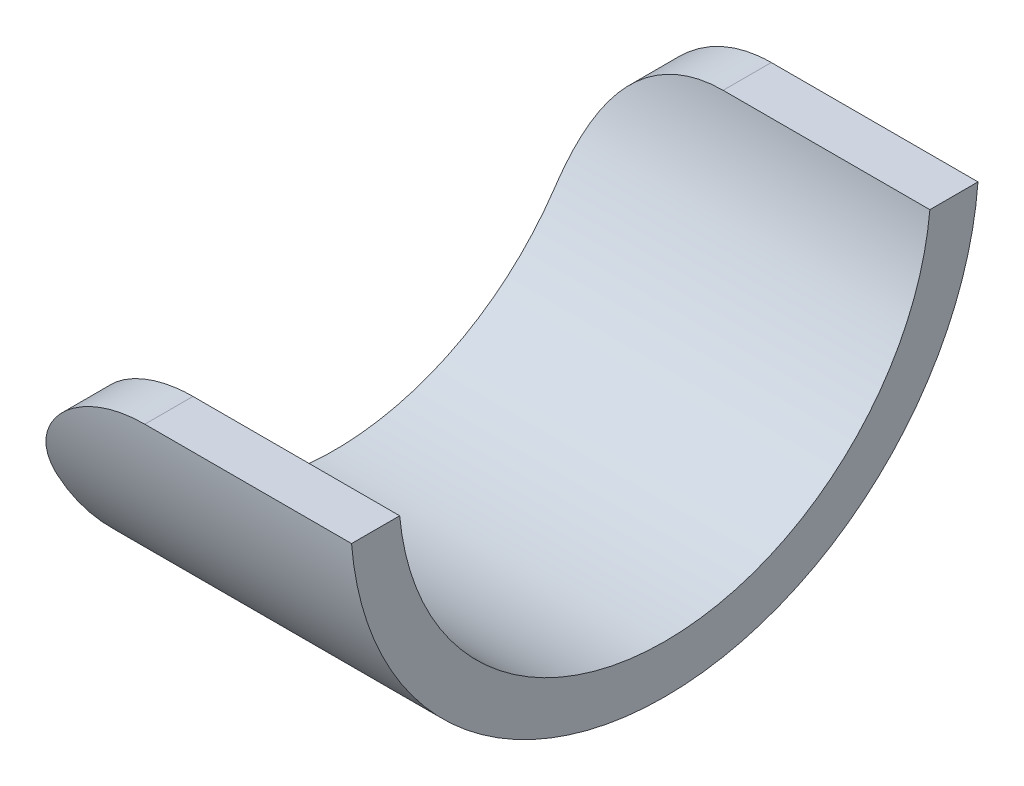
ISO-10303-21;
HEADER;
FILE_DESCRIPTION(('STEP AP214'),'2;1');
FILE_NAME('part.step','',(''),(''),'','','');
FILE_SCHEMA(('AUTOMOTIVE_DESIGN { 1 0 10303 214 1 1 1 1 }'));
ENDSEC;
DATA;
#1=APPLICATION_CONTEXT('core data for automotive mechanical design processes');
#2=APPLICATION_PROTOCOL_DEFINITION('international standard','automotive_design',2000,#1);
#3=PRODUCT_CONTEXT('',#1,'mechanical');
#4=PRODUCT('Part','Part','',(#3));
#5=PRODUCT_RELATED_PRODUCT_CATEGORY('part','',(#4));
#6=PRODUCT_DEFINITION_FORMATION('','',#4);
#7=PRODUCT_DEFINITION_CONTEXT('part definition',#1,'design');
#8=PRODUCT_DEFINITION('design','',#6,#7);
#9=PRODUCT_DEFINITION_SHAPE('','',#8);
#10=(LENGTH_UNIT() NAMED_UNIT(*) SI_UNIT(.MILLI.,.METRE.));
#11=(NAMED_UNIT(*) PLANE_ANGLE_UNIT() SI_UNIT($,.RADIAN.));
#12=(NAMED_UNIT(*) SI_UNIT($,.STERADIAN.) SOLID_ANGLE_UNIT());
#13=UNCERTAINTY_MEASURE_WITH_UNIT(LENGTH_MEASURE(1.E-05),#10,'distance_accuracy_value','');
#14=(GEOMETRIC_REPRESENTATION_CONTEXT(3) GLOBAL_UNCERTAINTY_ASSIGNED_CONTEXT((#13)) GLOBAL_UNIT_ASSIGNED_CONTEXT((#10,
#11,#12)) REPRESENTATION_CONTEXT('',''));
#15=CARTESIAN_POINT('',(0.,0.,0.));
#16=DIRECTION('',(0.,0.,1.));
#17=DIRECTION('',(1.,0.,0.));
#18=AXIS2_PLACEMENT_3D('',#15,#16,#17);
#19=CARTESIAN_POINT('',(25.4,0.,0.));
#20=DIRECTION('',(-1.,0.,0.));
#21=DIRECTION('',(0.,0.,1.));
#22=AXIS2_PLACEMENT_3D('',#19,#20,#21);
#23=CYLINDRICAL_SURFACE('',#22,24.13);
#24=CARTESIAN_POINT('',(0.,0.,0.));
#25=DIRECTION('',(1.,0.,0.));
#26=DIRECTION('',(0.,0.,-1.));
#27=AXIS2_PLACEMENT_3D('',#24,#25,#26);
#28=CIRCLE('',#27,24.13);
#29=CARTESIAN_POINT('',(0.,-11.43,21.2511646739655));
#30=VERTEX_POINT('',#29);
#31=CARTESIAN_POINT('',(0.,-11.43,-21.2511646739655));
#32=VERTEX_POINT('',#31);
#33=EDGE_CURVE('E159',#30,#32,#28,.T.);
#34=ORIENTED_EDGE('',*,*,#33,.T.);
#35=CARTESIAN_POINT('',(0.,-11.43,-21.2511646739655));
#36=CARTESIAN_POINT('',(-2.62243007126413E-05,-11.1860224640543,-21.3824335393108));
#37=CARTESIAN_POINT('',(0.00937477308694025,-10.9396845502003,-21.5094658719944));
#38=CARTESIAN_POINT('',(0.0479236395877504,-10.4439055163118,-21.7544876609394));
#39=CARTESIAN_POINT('',(0.0770830725086785,-10.1944626630503,-21.8724717766096));
#40=CARTESIAN_POINT('',(0.156118837118842,-9.69390311880306,-22.0988883031836));
#41=CARTESIAN_POINT('',(0.206034677985443,-9.44278413916173,-22.2073020174487));
#42=CARTESIAN_POINT('',(0.327202368802155,-8.94150477192952,-22.4138311063666));
#43=CARTESIAN_POINT('',(0.398449861662112,-8.69134419913753,-22.5119485785534));
#44=CARTESIAN_POINT('',(0.562964102877934,-8.19324315777415,-22.6979873973509));
#45=CARTESIAN_POINT('',(0.656316560719896,-7.94531533145705,-22.7858670176028));
#46=CARTESIAN_POINT('',(0.864917743170024,-7.45513554205446,-22.9509202864259));
#47=CARTESIAN_POINT('',(0.980168085088761,-7.21288399968737,-23.0280931434996));
#48=CARTESIAN_POINT('',(1.23201910546764,-6.73697795539725,-23.1717872843801));
#49=CARTESIAN_POINT('',(1.36858542185224,-6.50331035205277,-23.238325368346));
#50=CARTESIAN_POINT('',(1.66250238886438,-6.04664831564512,-23.3613112980713));
#51=CARTESIAN_POINT('',(1.81985155894157,-5.82365312382992,-23.4177598619249));
#52=CARTESIAN_POINT('',(2.14347109553134,-5.40470991060296,-23.5178520749754));
#53=CARTESIAN_POINT('',(2.3085037041298,-5.20794553211169,-23.562088255933));
#54=CARTESIAN_POINT('',(2.65479050631666,-4.82757709066209,-23.6429526368408));
#55=CARTESIAN_POINT('',(2.83604409448118,-4.64397253699317,-23.6795811205675));
#56=CARTESIAN_POINT('',(3.21363852043108,-4.29143598197451,-23.7460034791518));
#57=CARTESIAN_POINT('',(3.40998739998141,-4.12251190492314,-23.7757936768714));
#58=CARTESIAN_POINT('',(3.81630838261891,-3.80087139049984,-23.8293278664702));
#59=CARTESIAN_POINT('',(4.02628051460483,-3.64815498751076,-23.8530718455232));
#60=CARTESIAN_POINT('',(4.45704285565434,-3.36104542848596,-23.895213047223));
#61=CARTESIAN_POINT('',(4.67775947309696,-3.22654644377813,-23.9136419215247));
#62=CARTESIAN_POINT('',(5.12964311440567,-2.97581587645182,-23.9461355713094));
#63=CARTESIAN_POINT('',(5.36081023917931,-2.85958447026916,-23.960200304643));
#64=CARTESIAN_POINT('',(5.831928095831,-2.64628232956131,-23.9846954693647));
#65=CARTESIAN_POINT('',(6.07187653555342,-2.54920663658397,-23.9951268417838));
#66=CARTESIAN_POINT('',(6.55895637291033,-2.37488541721316,-24.0130070257699));
#67=CARTESIAN_POINT('',(6.80608684064031,-2.29763733623003,-24.0204562216298));
#68=CARTESIAN_POINT('',(7.25703859547032,-2.17660389124137,-24.0316919659944));
#69=CARTESIAN_POINT('',(7.45989511606065,-2.12922984902613,-24.0359096588211));
#70=CARTESIAN_POINT('',(7.86827969905803,-2.04787644322711,-24.0429774229925));
#71=CARTESIAN_POINT('',(8.07380739515986,-2.0138952626542,-24.0458276798666));
#72=CARTESIAN_POINT('',(8.48648285909893,-1.95949981658252,-24.0503232209338));
#73=CARTESIAN_POINT('',(8.69362909932989,-1.93907402968682,-24.0519695285443));
#74=CARTESIAN_POINT('',(9.10884950593469,-1.9118178800914,-24.0541447550348));
#75=CARTESIAN_POINT('',(9.31692380045259,-1.90498945704754,-24.0546735144979));
#76=CARTESIAN_POINT('',(9.525,-1.905,-24.0546850945923));
#77=B_SPLINE_CURVE_WITH_KNOTS('',3,(#35,#36,#37,#38,#39,#40,#41,#42,#43,#44,#45,#46,#47,#48,#49,
#50,#51,#52,#53,#54,#55,#56,#57,#58,#59,#60,#61,#62,#63,#64,#65,#66,#67,#68,#69,#70,#71,#72,#73,
#74,#75,#76),.UNSPECIFIED.,.F.,.F.,(4,2,2,2,2,2,2,2,2,2,2,2,2,2,2,2,2,2,2,2,4),(0.,
0.831053790770307,1.66259438406464,2.49572508742816,3.32868573588827,4.16493056434458,
5.0012371793046,5.83620930417523,6.67112197849129,7.45196225401338,8.23277339798149,
9.01400342752858,9.79523511433871,10.5717136526312,11.3481996900133,12.1244844697337,
12.9006691826562,13.5253091224103,14.1498642890198,14.7738879332271,15.3980005876607),.UNSPECIFIED.);
#78=CARTESIAN_POINT('',(9.525,-1.905,-24.0546850945923));
#79=VERTEX_POINT('',#78);
#80=EDGE_CURVE('E41',#32,#79,#77,.T.);
#81=ORIENTED_EDGE('',*,*,#80,.T.);
#82=DIRECTION('',(-1.,0.,0.));
#83=VECTOR('',#82,1.);
#84=CARTESIAN_POINT('',(25.4,-1.905,-24.0546850945923));
#85=LINE('',#84,#83);
#86=CARTESIAN_POINT('',(25.4,-1.905,-24.0546850945923));
#87=VERTEX_POINT('',#86);
#88=EDGE_CURVE('E93',#87,#79,#85,.T.);
#89=ORIENTED_EDGE('',*,*,#88,.F.);
#90=CARTESIAN_POINT('',(25.4,0.,0.));
#91=DIRECTION('',(1.,0.,0.));
#92=DIRECTION('',(0.,0.,-1.));
#93=AXIS2_PLACEMENT_3D('',#90,#91,#92);
#94=CIRCLE('',#93,24.13);
#95=CARTESIAN_POINT('',(25.4,-1.905,24.0546850945923));
#96=VERTEX_POINT('',#95);
#97=EDGE_CURVE('E100',#96,#87,#94,.T.);
#98=ORIENTED_EDGE('',*,*,#97,.F.);
#99=DIRECTION('',(-1.,0.,0.));
#100=VECTOR('',#99,1.);
#101=CARTESIAN_POINT('',(25.4,-1.905,24.0546850945923));
#102=LINE('',#101,#100);
#103=CARTESIAN_POINT('',(9.525,-1.905,24.0546850945923));
#104=VERTEX_POINT('',#103);
#105=EDGE_CURVE('E178',#96,#104,#102,.T.);
#106=ORIENTED_EDGE('',*,*,#105,.T.);
#107=CARTESIAN_POINT('',(9.525,-1.905,24.0546850945923));
#108=CARTESIAN_POINT('',(9.25902855860662,-1.90497112249098,24.0546543706783));
#109=CARTESIAN_POINT('',(8.99305996792605,-1.91613908815105,24.0538018907344));
#110=CARTESIAN_POINT('',(8.46300387273561,-1.9606612994031,24.0502314004206));
#111=CARTESIAN_POINT('',(8.1989163303127,-1.99401509654734,24.0475134277582));
#112=CARTESIAN_POINT('',(7.67456650786336,-2.08268810274374,24.0399910936523));
#113=CARTESIAN_POINT('',(7.41430308962371,-2.1380006327919,24.0351873665735));
#114=CARTESIAN_POINT('',(6.89937138401652,-2.2701777631287,24.0230644040504));
#115=CARTESIAN_POINT('',(6.6447029998715,-2.34704199031998,24.0157452121526));
#116=CARTESIAN_POINT('',(6.14260206552165,-2.52181707329971,23.9980216823762));
#117=CARTESIAN_POINT('',(5.89517469334633,-2.61974259140439,23.9876151932781));
#118=CARTESIAN_POINT('',(5.40953230749561,-2.83586324053376,23.9630257307452));
#119=CARTESIAN_POINT('',(5.17131717562001,-2.9540581113811,23.9488428057835));
#120=CARTESIAN_POINT('',(4.70588661033124,-3.20976539159897,23.9159133288637));
#121=CARTESIAN_POINT('',(4.47866874681592,-3.34727350681213,23.8971677906916));
#122=CARTESIAN_POINT('',(4.03685190596719,-3.64051036300694,23.8542560267361));
#123=CARTESIAN_POINT('',(3.82225273297257,-3.79623882135804,23.8300898850306));
#124=CARTESIAN_POINT('',(3.40913310360506,-4.12311644738061,23.7757019327644));
#125=CARTESIAN_POINT('',(3.21048485846543,-4.29411352349554,23.7455368268045));
#126=CARTESIAN_POINT('',(2.82856447170116,-4.65123007876344,23.6781748356056));
#127=CARTESIAN_POINT('',(2.64529225956836,-4.8373494885639,23.6409779826139));
#128=CARTESIAN_POINT('',(2.29548581756171,-5.22294907941939,23.5587888909164));
#129=CARTESIAN_POINT('',(2.12894399446347,-5.42242313023072,23.5138002140805));
#130=CARTESIAN_POINT('',(1.81359856584554,-5.83295582002549,23.4153383321293));
#131=CARTESIAN_POINT('',(1.6647945124326,-6.04401416629933,23.3618653413296));
#132=CARTESIAN_POINT('',(1.38874855215797,-6.47113711214399,23.2471317644862));
#133=CARTESIAN_POINT('',(1.26111596507832,-6.68700031712436,23.1860605993367));
#134=CARTESIAN_POINT('',(1.02423098390503,-7.12596104699,23.0549352631465));
#135=CARTESIAN_POINT('',(0.914978750332491,-7.34905863503499,22.9848810136632));
#136=CARTESIAN_POINT('',(0.715071957252479,-7.80069709441672,22.8355565811858));
#137=CARTESIAN_POINT('',(0.624434549431874,-8.02924277118396,22.7562780033086));
#138=CARTESIAN_POINT('',(0.461930113313286,-8.48959759740636,22.5885730040502));
#139=CARTESIAN_POINT('',(0.390061506300686,-8.72140647065202,22.5001473529379));
#140=CARTESIAN_POINT('',(0.271603413772416,-9.16141574281794,22.3243212812767));
#141=CARTESIAN_POINT('',(0.223127464472969,-9.36947657204716,22.2378315842086));
#142=CARTESIAN_POINT('',(0.140643449883782,-9.7854805725289,22.0579381550127));
#143=CARTESIAN_POINT('',(0.106635777848727,-9.99342374042991,21.9645342350342));
#144=CARTESIAN_POINT('',(0.0527401220690146,-10.4075477143405,21.771354509249));
#145=CARTESIAN_POINT('',(0.0328187663108996,-10.6137315346706,21.6715943779708));
#146=CARTESIAN_POINT('',(0.00644491721495352,-11.0238100019182,21.4659113001518));
#147=CARTESIAN_POINT('',(-1.12453408408947E-05,-11.2277052573949,21.3599900405856));
#148=CARTESIAN_POINT('',(0.,-11.43,21.2511646739655));
#149=B_SPLINE_CURVE_WITH_KNOTS('',3,(#107,#108,#109,#110,#111,#112,#113,#114,#115,#116,#117,
#118,#119,#120,#121,#122,#123,#124,#125,#126,#127,#128,#129,#130,#131,#132,#133,#134,#135,#136,
#137,#138,#139,#140,#141,#142,#143,#144,#145,#146,#147,#148),.UNSPECIFIED.,.F.,.F.,(4,2,2,2,2,2,
2,2,2,2,2,2,2,2,2,2,2,2,2,2,4),(0.,0.797674807200183,1.59533349129078,2.39274974387176,
3.19015219264293,3.98811157936095,4.78606072424157,5.58383273105668,6.38159236462163,
7.17214191497642,7.96268783999794,8.75287333268876,9.54303886831846,10.316430031771,
11.0898279491281,11.8639353089751,12.6379775347455,13.3288503903548,14.0197420230188,
14.7089913240004,15.3980527824104),.UNSPECIFIED.);
#150=EDGE_CURVE('E48',#104,#30,#149,.T.);
#151=ORIENTED_EDGE('',*,*,#150,.T.);
#152=EDGE_LOOP('',(#34,#81,#89,#98,#106,#151));
#153=FACE_BOUND('',#152,.T.);
#154=ADVANCED_FACE('F32',(#153),#23,.T.);
#155=CARTESIAN_POINT('',(25.4,-1.905,-20.3580643480661));
#156=DIRECTION('',(0.,-1.,0.));
#157=DIRECTION('',(0.,0.,-1.));
#158=AXIS2_PLACEMENT_3D('',#155,#156,#157);
#159=PLANE('',#158);
#160=ORIENTED_EDGE('',*,*,#88,.T.);
#161=DIRECTION('',(0.,0.,1.));
#162=VECTOR('',#161,1.);
#163=CARTESIAN_POINT('',(9.525,-1.905,-20.3580643480661));
#164=LINE('',#163,#162);
#165=CARTESIAN_POINT('',(9.525,-1.905,-20.3580643480661));
#166=VERTEX_POINT('',#165);
#167=EDGE_CURVE('E112',#79,#166,#164,.T.);
#168=ORIENTED_EDGE('',*,*,#167,.T.);
#169=DIRECTION('',(-1.,0.,0.));
#170=VECTOR('',#169,1.);
#171=CARTESIAN_POINT('',(25.4,-1.905,-20.3580643480661));
#172=LINE('',#171,#170);
#173=CARTESIAN_POINT('',(25.4,-1.905,-20.3580643480661));
#174=VERTEX_POINT('',#173);
#175=EDGE_CURVE('E96',#174,#166,#172,.T.);
#176=ORIENTED_EDGE('',*,*,#175,.F.);
#177=DIRECTION('',(0.,0.,1.));
#178=VECTOR('',#177,1.);
#179=CARTESIAN_POINT('',(25.4,-1.905,-20.3580643480661));
#180=LINE('',#179,#178);
#181=EDGE_CURVE('E88',#87,#174,#180,.T.);
#182=ORIENTED_EDGE('',*,*,#181,.F.);
#183=EDGE_LOOP('',(#160,#168,#176,#182));
#184=FACE_BOUND('',#183,.T.);
#185=ADVANCED_FACE('F90',(#184),#159,.F.);
#186=CARTESIAN_POINT('',(25.4,0.,0.));
#187=DIRECTION('',(-1.,0.,0.));
#188=DIRECTION('',(0.,0.,1.));
#189=AXIS2_PLACEMENT_3D('',#186,#187,#188);
#190=CYLINDRICAL_SURFACE('',#189,20.447);
#191=ORIENTED_EDGE('',*,*,#175,.T.);
#192=CARTESIAN_POINT('',(9.525,-1.905,-20.3580643480661));
#193=CARTESIAN_POINT('',(9.25978977014526,-1.90497110377044,-20.3580283743182));
#194=CARTESIAN_POINT('',(8.99458190205295,-1.91607541741178,-20.3570267347558));
#195=CARTESIAN_POINT('',(8.46603330595991,-1.96034336128463,-20.352832188804));
#196=CARTESIAN_POINT('',(8.20269256023756,-1.99350678186011,-20.3496393032408));
#197=CARTESIAN_POINT('',(7.67976710818044,-2.08168051639916,-20.3408028731761));
#198=CARTESIAN_POINT('',(7.42018195184562,-2.13668819010333,-20.3351596248361));
#199=CARTESIAN_POINT('',(6.9065823565463,-2.26813517562933,-20.3209194671558));
#200=CARTESIAN_POINT('',(6.65256781040154,-2.34457407471702,-20.312322614697));
#201=CARTESIAN_POINT('',(6.15172905872527,-2.51837915517059,-20.2915062917797));
#202=CARTESIAN_POINT('',(5.90491062304745,-2.61576163208616,-20.2792839976529));
#203=CARTESIAN_POINT('',(5.42046974204375,-2.83065885374987,-20.2504056126832));
#204=CARTESIAN_POINT('',(5.18284713201861,-2.94817323772638,-20.2337496012912));
#205=CARTESIAN_POINT('',(4.71860313323052,-3.20235227155138,-20.1950801117434));
#206=CARTESIAN_POINT('',(4.49197903223694,-3.33901216747872,-20.1730679625452));
#207=CARTESIAN_POINT('',(4.05136405145136,-3.63034088398203,-20.1226806227278));
#208=CARTESIAN_POINT('',(3.83737292244127,-3.78500934911329,-20.0943055576867));
#209=CARTESIAN_POINT('',(3.42620891630364,-4.10893379759801,-20.030560824482));
#210=CARTESIAN_POINT('',(3.22885954487623,-4.27798374878302,-19.9952828225731));
#211=CARTESIAN_POINT('',(2.84947281277147,-4.63073177356297,-19.9165452957226));
#212=CARTESIAN_POINT('',(2.66743532964771,-4.81442972999756,-19.8730858362156));
#213=CARTESIAN_POINT('',(2.32005992918782,-5.19456017598146,-19.7771267369428));
#214=CARTESIAN_POINT('',(2.15471065709082,-5.39098385541035,-19.724633310632));
#215=CARTESIAN_POINT('',(1.84162833815016,-5.79469430757571,-19.6098279166227));
#216=CARTESIAN_POINT('',(1.69389475833076,-6.00198075137795,-19.5475162461149));
#217=CARTESIAN_POINT('',(1.42089667288137,-6.41906899364777,-19.4144755131979));
#218=CARTESIAN_POINT('',(1.29510049382968,-6.62861897179975,-19.3440467118341));
#219=CARTESIAN_POINT('',(1.06130049022161,-7.05389488573657,-19.1930529525103));
#220=CARTESIAN_POINT('',(0.953296570547871,-7.26962078849771,-19.112488048742));
#221=CARTESIAN_POINT('',(0.755103699314461,-7.70549373801177,-18.9409635820805));
#222=CARTESIAN_POINT('',(0.664940401084745,-7.92564665685008,-18.8499893436497));
#223=CARTESIAN_POINT('',(0.50249570259122,-8.36804475355946,-18.6578079286869));
#224=CARTESIAN_POINT('',(0.430213517538051,-8.59028983916225,-18.5566012015262));
#225=CARTESIAN_POINT('',(0.303153739250019,-9.03487826701944,-18.3442481822495));
#226=CARTESIAN_POINT('',(0.248367946006984,-9.25722151419619,-18.23310657765));
#227=CARTESIAN_POINT('',(0.155607328845854,-9.70043791104361,-18.0012194838147));
#228=CARTESIAN_POINT('',(0.117635672778708,-9.92131077597413,-17.8804721898794));
#229=CARTESIAN_POINT('',(0.057778548534097,-10.3594428106769,-17.6302342348168));
#230=CARTESIAN_POINT('',(0.0358505781251143,-10.5767100272518,-17.5007676745597));
#231=CARTESIAN_POINT('',(0.00695864841239081,-11.0068892110165,-17.2334730625406));
#232=CARTESIAN_POINT('',(-1.40946185446643E-05,-11.2198036619075,-17.0956499678064));
#233=CARTESIAN_POINT('',(0.,-11.43,-16.9539054202859));
#234=B_SPLINE_CURVE_WITH_KNOTS('',3,(#192,#193,#194,#195,#196,#197,#198,#199,#200,#201,#202,
#203,#204,#205,#206,#207,#208,#209,#210,#211,#212,#213,#214,#215,#216,#217,#218,#219,#220,#221,
#222,#223,#224,#225,#226,#227,#228,#229,#230,#231,#232,#233),.UNSPECIFIED.,.F.,.F.,(4,2,2,2,2,2,
2,2,2,2,2,2,2,2,2,2,2,2,2,2,4),(0.,0.795393423654686,1.59077928777243,2.38606904486716,
3.18134348689319,3.97723896055609,4.77312017295292,5.5688041133931,6.3644723516572,
7.15021538340832,7.93595213111672,8.72115060258975,9.5063253112738,10.2684854549721,
11.0306415240326,11.7938856708571,12.5570963134924,13.319948736603,14.082944823085,
14.8439122217054,15.604432555074),.UNSPECIFIED.);
#235=CARTESIAN_POINT('',(0.,-11.43,-16.9539054202859));
#236=VERTEX_POINT('',#235);
#237=EDGE_CURVE('E125',#166,#236,#234,.T.);
#238=ORIENTED_EDGE('',*,*,#237,.T.);
#239=CARTESIAN_POINT('',(0.,0.,0.));
#240=DIRECTION('',(-1.,0.,0.));
#241=DIRECTION('',(0.,0.,-1.));
#242=AXIS2_PLACEMENT_3D('',#239,#240,#241);
#243=CIRCLE('',#242,20.447);
#244=CARTESIAN_POINT('',(0.,-11.43,16.9539054202859));
#245=VERTEX_POINT('',#244);
#246=EDGE_CURVE('E109',#236,#245,#243,.T.);
#247=ORIENTED_EDGE('',*,*,#246,.T.);
#248=CARTESIAN_POINT('',(0.,-11.43,16.9539054202859));
#249=CARTESIAN_POINT('',(-2.26556267190623E-05,-11.1970109347333,17.1110348965797));
#250=CARTESIAN_POINT('',(0.00854996527283876,-10.9606584924522,17.2633409521735));
#251=CARTESIAN_POINT('',(0.0441943253259937,-10.4827345096676,17.557631634213));
#252=CARTESIAN_POINT('',(0.0712805745076498,-10.241159019522,17.6996080681937));
#253=CARTESIAN_POINT('',(0.145377805371788,-9.75392492005596,17.9727321356884));
#254=CARTESIAN_POINT('',(0.192449364536353,-9.50825609668595,18.1038453856936));
#255=CARTESIAN_POINT('',(0.307566450309029,-9.01577956315671,18.3540664977231));
#256=CARTESIAN_POINT('',(0.375606449191654,-8.76897217001962,18.4731775128226));
#257=CARTESIAN_POINT('',(0.53383245903843,-8.27531248509759,18.6995490297245));
#258=CARTESIAN_POINT('',(0.624131647136172,-8.02846661678016,18.8067447749873));
#259=CARTESIAN_POINT('',(0.827078092665168,-7.53872313086899,19.0083559040058));
#260=CARTESIAN_POINT('',(0.939727382262767,-7.29582587447428,19.1027701242966));
#261=CARTESIAN_POINT('',(1.18702756275254,-6.81738744881128,19.2786895398164));
#262=CARTESIAN_POINT('',(1.32162936657595,-6.58183123312698,19.3602227547461));
#263=CARTESIAN_POINT('',(1.61248686004771,-6.12037421258529,19.5110161349573));
#264=CARTESIAN_POINT('',(1.76874040418349,-5.89447245394763,19.580277514731));
#265=CARTESIAN_POINT('',(2.08719310004087,-5.47451213954638,19.7015990829017));
#266=CARTESIAN_POINT('',(2.24764088450731,-5.27940511020473,19.7546393047696));
#267=CARTESIAN_POINT('',(2.58476100175011,-4.90138340496377,19.8518094278578));
#268=CARTESIAN_POINT('',(2.76143244282964,-4.71846805992848,19.8959398183609));
#269=CARTESIAN_POINT('',(3.12994468473486,-4.36644050139834,19.976151579886));
#270=CARTESIAN_POINT('',(3.32179551996768,-4.19733757130689,20.0122275652699));
#271=CARTESIAN_POINT('',(3.7192248194697,-3.87459604014138,20.0772114901172));
#272=CARTESIAN_POINT('',(3.92480339005321,-3.72095755885468,20.1061193740592));
#273=CARTESIAN_POINT('',(4.34587685286661,-3.43207667548693,20.1574291495039));
#274=CARTESIAN_POINT('',(4.56123652101523,-3.29664918935762,20.1798996243166));
#275=CARTESIAN_POINT('',(5.00256224098035,-3.04322714023593,20.2196697315629));
#276=CARTESIAN_POINT('',(5.22853303698627,-2.92524047465008,20.2369670251252));
#277=CARTESIAN_POINT('',(5.68939336395446,-2.7076913191788,20.2672218373143));
#278=CARTESIAN_POINT('',(5.92428109734117,-2.6081251394077,20.2801802255078));
#279=CARTESIAN_POINT('',(6.40133118829256,-2.42815162760385,20.3025150068543));
#280=CARTESIAN_POINT('',(6.64349011485936,-2.34773541457401,20.3118930616464));
#281=CARTESIAN_POINT('',(7.10242990400114,-2.21553591633533,20.3267077281063));
#282=CARTESIAN_POINT('',(7.31852976669072,-2.16141368417318,20.3324935680789));
#283=CARTESIAN_POINT('',(7.75401731871972,-2.06843955546321,20.3421616557291));
#284=CARTESIAN_POINT('',(7.97340471224863,-2.02958629348418,20.3460440736285));
#285=CARTESIAN_POINT('',(8.41426514810789,-1.96736786921801,20.352157279265));
#286=CARTESIAN_POINT('',(8.63573700720965,-1.94399440122065,20.3543889527872));
#287=CARTESIAN_POINT('',(9.0798052484316,-1.91280264393239,20.3573335916408));
#288=CARTESIAN_POINT('',(9.30240173911299,-1.9049858862538,20.358046407436));
#289=CARTESIAN_POINT('',(9.525,-1.905,20.3580643480661));
#290=B_SPLINE_CURVE_WITH_KNOTS('',3,(#248,#249,#250,#251,#252,#253,#254,#255,#256,#257,#258,
#259,#260,#261,#262,#263,#264,#265,#266,#267,#268,#269,#270,#271,#272,#273,#274,#275,#276,#277,
#278,#279,#280,#281,#282,#283,#284,#285,#286,#287,#288,#289),.UNSPECIFIED.,.F.,.F.,(4,2,2,2,2,2,
2,2,2,2,2,2,2,2,2,2,2,2,2,2,4),(0.,0.843012231859918,1.68668593203055,2.53293535688566,
3.37896188300092,4.22938213047316,5.07987973723859,5.92850102018458,6.77703827167067,
7.55044553476625,8.32381031468301,9.09769067222045,9.87157702376157,10.6368826673749,
11.4025337956783,12.1680313867012,12.9331732758271,13.6011795842373,14.2691261424273,
14.9367140217581,15.6043676241904),.UNSPECIFIED.);
#291=CARTESIAN_POINT('',(9.525,-1.905,20.3580643480661));
#292=VERTEX_POINT('',#291);
#293=EDGE_CURVE('E114',#245,#292,#290,.T.);
#294=ORIENTED_EDGE('',*,*,#293,.T.);
#295=DIRECTION('',(-1.,0.,0.));
#296=VECTOR('',#295,1.);
#297=CARTESIAN_POINT('',(25.4,-1.905,20.3580643480661));
#298=LINE('',#297,#296);
#299=CARTESIAN_POINT('',(25.4,-1.905,20.3580643480661));
#300=VERTEX_POINT('',#299);
#301=EDGE_CURVE('E116',#300,#292,#298,.T.);
#302=ORIENTED_EDGE('',*,*,#301,.F.);
#303=CARTESIAN_POINT('',(25.4,0.,0.));
#304=DIRECTION('',(-1.,0.,0.));
#305=DIRECTION('',(0.,0.,-1.));
#306=AXIS2_PLACEMENT_3D('',#303,#304,#305);
#307=CIRCLE('',#306,20.447);
#308=EDGE_CURVE('E99',#174,#300,#307,.T.);
#309=ORIENTED_EDGE('',*,*,#308,.F.);
#310=EDGE_LOOP('',(#191,#238,#247,#294,#302,#309));
#311=FACE_BOUND('',#310,.T.);
#312=ADVANCED_FACE('F130',(#311),#190,.F.);
#313=CARTESIAN_POINT('',(25.4,-1.905,24.0546850945923));
#314=DIRECTION('',(0.,-1.,0.));
#315=DIRECTION('',(0.,0.,-1.));
#316=AXIS2_PLACEMENT_3D('',#313,#314,#315);
#317=PLANE('',#316);
#318=ORIENTED_EDGE('',*,*,#301,.T.);
#319=DIRECTION('',(0.,0.,1.));
#320=VECTOR('',#319,1.);
#321=CARTESIAN_POINT('',(9.525,-1.905,24.0546850945923));
#322=LINE('',#321,#320);
#323=EDGE_CURVE('E11',#292,#104,#322,.T.);
#324=ORIENTED_EDGE('',*,*,#323,.T.);
#325=ORIENTED_EDGE('',*,*,#105,.F.);
#326=DIRECTION('',(0.,0.,1.));
#327=VECTOR('',#326,1.);
#328=CARTESIAN_POINT('',(25.4,-1.905,24.0546850945923));
#329=LINE('',#328,#327);
#330=EDGE_CURVE('E105',#300,#96,#329,.T.);
#331=ORIENTED_EDGE('',*,*,#330,.F.);
#332=EDGE_LOOP('',(#318,#324,#325,#331));
#333=FACE_BOUND('',#332,.T.);
#334=ADVANCED_FACE('F135',(#333),#317,.F.);
#335=CARTESIAN_POINT('',(25.4,0.,0.));
#336=DIRECTION('',(1.,0.,0.));
#337=DIRECTION('',(0.,0.,-1.));
#338=AXIS2_PLACEMENT_3D('',#335,#336,#337);
#339=PLANE('',#338);
#340=ORIENTED_EDGE('',*,*,#97,.T.);
#341=ORIENTED_EDGE('',*,*,#181,.T.);
#342=ORIENTED_EDGE('',*,*,#308,.T.);
#343=ORIENTED_EDGE('',*,*,#330,.T.);
#344=EDGE_LOOP('',(#340,#341,#342,#343));
#345=FACE_BOUND('',#344,.T.);
#346=ADVANCED_FACE('F103',(#345),#339,.T.);
#347=CARTESIAN_POINT('',(0.,0.,0.));
#348=DIRECTION('',(1.,0.,0.));
#349=DIRECTION('',(0.,0.,-1.));
#350=AXIS2_PLACEMENT_3D('',#347,#348,#349);
#351=PLANE('',#350);
#352=ORIENTED_EDGE('',*,*,#246,.F.);
#353=DIRECTION('',(0.,0.,1.));
#354=VECTOR('',#353,1.);
#355=CARTESIAN_POINT('',(0.,-11.43,0.));
#356=LINE('',#355,#354);
#357=EDGE_CURVE('E55',#236,#32,#356,.F.);
#358=ORIENTED_EDGE('',*,*,#357,.T.);
#359=ORIENTED_EDGE('',*,*,#33,.F.);
#360=DIRECTION('',(0.,0.,1.));
#361=VECTOR('',#360,1.);
#362=CARTESIAN_POINT('',(0.,-11.43,0.));
#363=LINE('',#362,#361);
#364=EDGE_CURVE('E154',#30,#245,#363,.F.);
#365=ORIENTED_EDGE('',*,*,#364,.T.);
#366=EDGE_LOOP('',(#352,#358,#359,#365));
#367=FACE_BOUND('',#366,.T.);
#368=ADVANCED_FACE('F158',(#367),#351,.F.);
#369=CARTESIAN_POINT('',(9.525,-11.43,-20.3580643480661));
#370=DIRECTION('',(0.,0.,1.));
#371=DIRECTION('',(1.,0.,0.));
#372=AXIS2_PLACEMENT_3D('',#369,#370,#371);
#373=CYLINDRICAL_SURFACE('',#372,9.525);
#374=ORIENTED_EDGE('',*,*,#80,.F.);
#375=ORIENTED_EDGE('',*,*,#357,.F.);
#376=ORIENTED_EDGE('',*,*,#237,.F.);
#377=ORIENTED_EDGE('',*,*,#167,.F.);
#378=EDGE_LOOP('',(#374,#375,#376,#377));
#379=FACE_BOUND('',#378,.T.);
#380=ADVANCED_FACE('F143',(#379),#373,.T.);
#381=CARTESIAN_POINT('',(9.525,-11.43,24.0546850945923));
#382=DIRECTION('',(0.,0.,1.));
#383=DIRECTION('',(1.,0.,0.));
#384=AXIS2_PLACEMENT_3D('',#381,#382,#383);
#385=CYLINDRICAL_SURFACE('',#384,9.525);
#386=ORIENTED_EDGE('',*,*,#293,.F.);
#387=ORIENTED_EDGE('',*,*,#364,.F.);
#388=ORIENTED_EDGE('',*,*,#150,.F.);
#389=ORIENTED_EDGE('',*,*,#323,.F.);
#390=EDGE_LOOP('',(#386,#387,#388,#389));
#391=FACE_BOUND('',#390,.T.);
#392=ADVANCED_FACE('F34',(#391),#385,.T.);
#393=CLOSED_SHELL('',(#154,#185,#312,#334,#346,#368,#380,#392));
#394=MANIFOLD_SOLID_BREP('B2',#393);
#395=ADVANCED_BREP_SHAPE_REPRESENTATION('',(#18,#394),#14);
#396=SHAPE_DEFINITION_REPRESENTATION(#9,#395);
ENDSEC;
END-ISO-10303-21;
